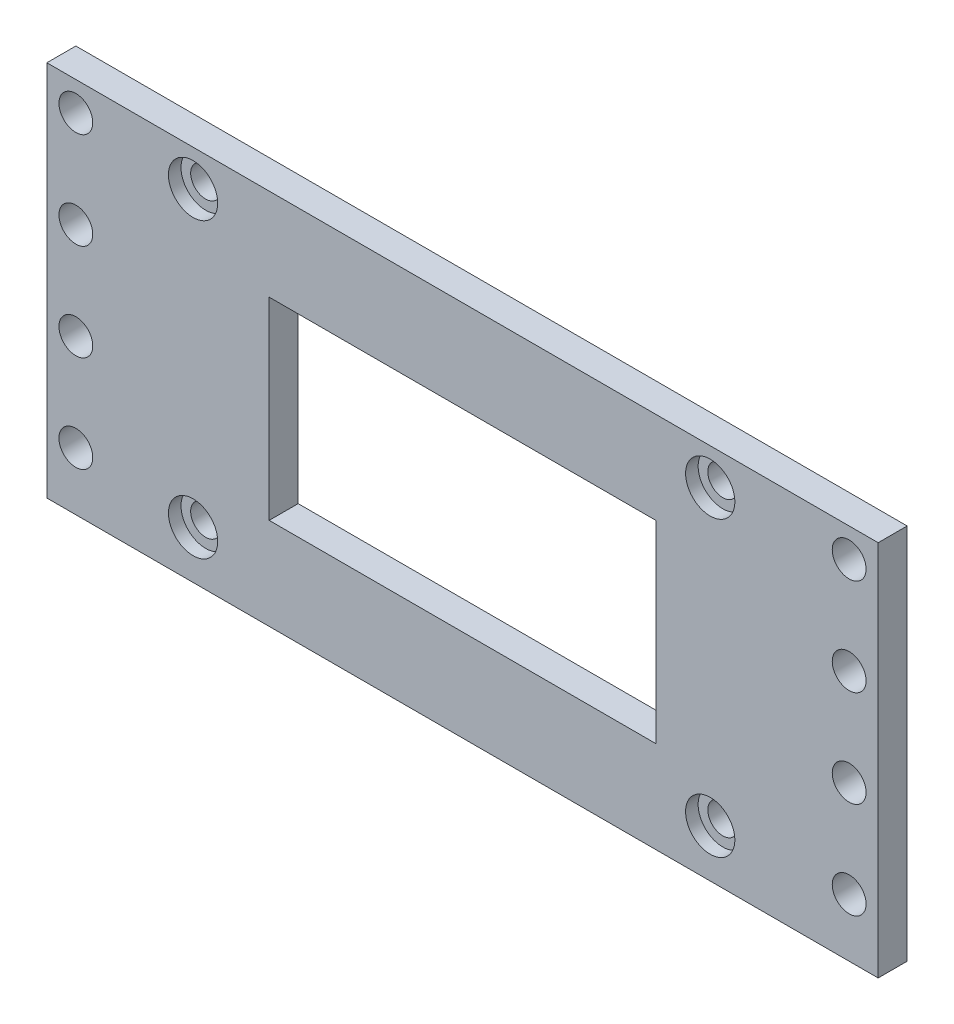
ISO-10303-21;
HEADER;
FILE_DESCRIPTION(('STEP AP214'),'2;1');
FILE_NAME('part.step','',(''),(''),'','','');
FILE_SCHEMA(('AUTOMOTIVE_DESIGN { 1 0 10303 214 1 1 1 1 }'));
ENDSEC;
DATA;
#1=APPLICATION_CONTEXT('core data for automotive mechanical design processes');
#2=APPLICATION_PROTOCOL_DEFINITION('international standard','automotive_design',2000,#1);
#3=PRODUCT_CONTEXT('',#1,'mechanical');
#4=PRODUCT('Part','Part','',(#3));
#5=PRODUCT_RELATED_PRODUCT_CATEGORY('part','',(#4));
#6=PRODUCT_DEFINITION_FORMATION('','',#4);
#7=PRODUCT_DEFINITION_CONTEXT('part definition',#1,'design');
#8=PRODUCT_DEFINITION('design','',#6,#7);
#9=PRODUCT_DEFINITION_SHAPE('','',#8);
#10=(LENGTH_UNIT() NAMED_UNIT(*) SI_UNIT(.MILLI.,.METRE.));
#11=(NAMED_UNIT(*) PLANE_ANGLE_UNIT() SI_UNIT($,.RADIAN.));
#12=(NAMED_UNIT(*) SI_UNIT($,.STERADIAN.) SOLID_ANGLE_UNIT());
#13=UNCERTAINTY_MEASURE_WITH_UNIT(LENGTH_MEASURE(1.E-05),#10,'distance_accuracy_value','');
#14=(GEOMETRIC_REPRESENTATION_CONTEXT(3) GLOBAL_UNCERTAINTY_ASSIGNED_CONTEXT((#13)) GLOBAL_UNIT_ASSIGNED_CONTEXT((#10,
#11,#12)) REPRESENTATION_CONTEXT('',''));
#15=CARTESIAN_POINT('',(0.,0.,0.));
#16=DIRECTION('',(0.,0.,1.));
#17=DIRECTION('',(1.,0.,0.));
#18=AXIS2_PLACEMENT_3D('',#15,#16,#17);
#19=CARTESIAN_POINT('',(-27.8730845870091,15.75,3.));
#20=DIRECTION('',(0.,0.,-1.));
#21=DIRECTION('',(-1.,0.,0.));
#22=AXIS2_PLACEMENT_3D('',#19,#20,#21);
#23=CYLINDRICAL_SURFACE('',#22,1.55);
#24=CARTESIAN_POINT('',(-27.8730845870091,15.75,0.));
#25=DIRECTION('',(0.,0.,1.));
#26=DIRECTION('',(1.,0.,0.));
#27=AXIS2_PLACEMENT_3D('',#24,#25,#26);
#28=CIRCLE('',#27,1.55);
#29=CARTESIAN_POINT('',(-26.3230845870091,15.75,0.));
#30=VERTEX_POINT('',#29);
#31=EDGE_CURVE('E11',#30,#30,#28,.T.);
#32=ORIENTED_EDGE('',*,*,#31,.F.);
#33=EDGE_LOOP('',(#32));
#34=FACE_BOUND('',#33,.T.);
#35=CARTESIAN_POINT('',(-27.8730845870091,15.75,1.7));
#36=DIRECTION('',(0.,0.,1.));
#37=DIRECTION('',(1.,0.,0.));
#38=AXIS2_PLACEMENT_3D('',#35,#36,#37);
#39=CIRCLE('',#38,1.55);
#40=CARTESIAN_POINT('',(-26.3230845870091,15.75,1.7));
#41=VERTEX_POINT('',#40);
#42=EDGE_CURVE('E47',#41,#41,#39,.T.);
#43=ORIENTED_EDGE('',*,*,#42,.T.);
#44=EDGE_LOOP('',(#43));
#45=FACE_BOUND('',#44,.T.);
#46=ADVANCED_FACE('F43',(#34,#45),#23,.F.);
#47=CARTESIAN_POINT('',(25.6269154129909,15.75,3.));
#48=DIRECTION('',(0.,0.,-1.));
#49=DIRECTION('',(-1.,0.,0.));
#50=AXIS2_PLACEMENT_3D('',#47,#48,#49);
#51=CYLINDRICAL_SURFACE('',#50,1.55);
#52=CARTESIAN_POINT('',(25.6269154129909,15.75,0.));
#53=DIRECTION('',(0.,0.,1.));
#54=DIRECTION('',(-1.,0.,0.));
#55=AXIS2_PLACEMENT_3D('',#52,#53,#54);
#56=CIRCLE('',#55,1.55);
#57=CARTESIAN_POINT('',(24.0769154129909,15.75,0.));
#58=VERTEX_POINT('',#57);
#59=EDGE_CURVE('E53',#58,#58,#56,.T.);
#60=ORIENTED_EDGE('',*,*,#59,.F.);
#61=EDGE_LOOP('',(#60));
#62=FACE_BOUND('',#61,.T.);
#63=CARTESIAN_POINT('',(25.6269154129909,15.75,1.7));
#64=DIRECTION('',(0.,0.,1.));
#65=DIRECTION('',(1.,0.,0.));
#66=AXIS2_PLACEMENT_3D('',#63,#64,#65);
#67=CIRCLE('',#66,1.55);
#68=CARTESIAN_POINT('',(27.1769154129909,15.75,1.7));
#69=VERTEX_POINT('',#68);
#70=EDGE_CURVE('E213',#69,#69,#67,.T.);
#71=ORIENTED_EDGE('',*,*,#70,.T.);
#72=EDGE_LOOP('',(#71));
#73=FACE_BOUND('',#72,.T.);
#74=ADVANCED_FACE('F260',(#62,#73),#51,.F.);
#75=CARTESIAN_POINT('',(-27.8730845870091,-14.55,3.));
#76=DIRECTION('',(0.,0.,-1.));
#77=DIRECTION('',(-1.,0.,0.));
#78=AXIS2_PLACEMENT_3D('',#75,#76,#77);
#79=CYLINDRICAL_SURFACE('',#78,1.55);
#80=CARTESIAN_POINT('',(-27.8730845870091,-14.55,0.));
#81=DIRECTION('',(0.,0.,1.));
#82=DIRECTION('',(-1.,0.,0.));
#83=AXIS2_PLACEMENT_3D('',#80,#81,#82);
#84=CIRCLE('',#83,1.55);
#85=CARTESIAN_POINT('',(-29.4230845870091,-14.55,0.));
#86=VERTEX_POINT('',#85);
#87=EDGE_CURVE('E198',#86,#86,#84,.T.);
#88=ORIENTED_EDGE('',*,*,#87,.F.);
#89=EDGE_LOOP('',(#88));
#90=FACE_BOUND('',#89,.T.);
#91=CARTESIAN_POINT('',(-27.8730845870091,-14.55,1.7));
#92=DIRECTION('',(0.,0.,1.));
#93=DIRECTION('',(1.,0.,0.));
#94=AXIS2_PLACEMENT_3D('',#91,#92,#93);
#95=CIRCLE('',#94,1.55);
#96=CARTESIAN_POINT('',(-26.3230845870091,-14.55,1.7));
#97=VERTEX_POINT('',#96);
#98=EDGE_CURVE('E209',#97,#97,#95,.T.);
#99=ORIENTED_EDGE('',*,*,#98,.T.);
#100=EDGE_LOOP('',(#99));
#101=FACE_BOUND('',#100,.T.);
#102=ADVANCED_FACE('F266',(#90,#101),#79,.F.);
#103=CARTESIAN_POINT('',(25.6269154129909,-14.55,3.));
#104=DIRECTION('',(0.,0.,-1.));
#105=DIRECTION('',(-1.,0.,0.));
#106=AXIS2_PLACEMENT_3D('',#103,#104,#105);
#107=CYLINDRICAL_SURFACE('',#106,1.55);
#108=CARTESIAN_POINT('',(25.6269154129909,-14.55,0.));
#109=DIRECTION('',(0.,0.,1.));
#110=DIRECTION('',(1.,0.,0.));
#111=AXIS2_PLACEMENT_3D('',#108,#109,#110);
#112=CIRCLE('',#111,1.55);
#113=CARTESIAN_POINT('',(27.1769154129909,-14.55,0.));
#114=VERTEX_POINT('',#113);
#115=EDGE_CURVE('E194',#114,#114,#112,.T.);
#116=ORIENTED_EDGE('',*,*,#115,.F.);
#117=EDGE_LOOP('',(#116));
#118=FACE_BOUND('',#117,.T.);
#119=CARTESIAN_POINT('',(25.6269154129909,-14.55,1.7));
#120=DIRECTION('',(0.,0.,1.));
#121=DIRECTION('',(1.,0.,0.));
#122=AXIS2_PLACEMENT_3D('',#119,#120,#121);
#123=CIRCLE('',#122,1.55);
#124=CARTESIAN_POINT('',(27.1769154129909,-14.55,1.7));
#125=VERTEX_POINT('',#124);
#126=EDGE_CURVE('E205',#125,#125,#123,.T.);
#127=ORIENTED_EDGE('',*,*,#126,.T.);
#128=EDGE_LOOP('',(#127));
#129=FACE_BOUND('',#128,.T.);
#130=ADVANCED_FACE('F272',(#118,#129),#107,.F.);
#131=CARTESIAN_POINT('',(0.,0.,3.));
#132=DIRECTION('',(0.,0.,-1.));
#133=DIRECTION('',(-1.,0.,0.));
#134=AXIS2_PLACEMENT_3D('',#131,#132,#133);
#135=PLANE('',#134);
#136=CARTESIAN_POINT('',(-40.,-13.5,3.));
#137=DIRECTION('',(0.,0.,-1.));
#138=DIRECTION('',(-1.,0.,0.));
#139=AXIS2_PLACEMENT_3D('',#136,#137,#138);
#140=CIRCLE('',#139,1.75);
#141=CARTESIAN_POINT('',(-41.75,-13.5,3.));
#142=VERTEX_POINT('',#141);
#143=EDGE_CURVE('E285',#142,#142,#140,.T.);
#144=ORIENTED_EDGE('',*,*,#143,.T.);
#145=EDGE_LOOP('',(#144));
#146=FACE_BOUND('',#145,.T.);
#147=CARTESIAN_POINT('',(-40.,-3.5,3.));
#148=DIRECTION('',(0.,0.,-1.));
#149=DIRECTION('',(-1.,0.,0.));
#150=AXIS2_PLACEMENT_3D('',#147,#148,#149);
#151=CIRCLE('',#150,1.75);
#152=CARTESIAN_POINT('',(-41.75,-3.5,3.));
#153=VERTEX_POINT('',#152);
#154=EDGE_CURVE('E289',#153,#153,#151,.T.);
#155=ORIENTED_EDGE('',*,*,#154,.T.);
#156=EDGE_LOOP('',(#155));
#157=FACE_BOUND('',#156,.T.);
#158=CARTESIAN_POINT('',(-40.,6.5,3.));
#159=DIRECTION('',(0.,0.,-1.));
#160=DIRECTION('',(-1.,0.,0.));
#161=AXIS2_PLACEMENT_3D('',#158,#159,#160);
#162=CIRCLE('',#161,1.75);
#163=CARTESIAN_POINT('',(-41.75,6.5,3.));
#164=VERTEX_POINT('',#163);
#165=EDGE_CURVE('E293',#164,#164,#162,.T.);
#166=ORIENTED_EDGE('',*,*,#165,.T.);
#167=EDGE_LOOP('',(#166));
#168=FACE_BOUND('',#167,.T.);
#169=CARTESIAN_POINT('',(-40.,16.5,3.));
#170=DIRECTION('',(0.,0.,-1.));
#171=DIRECTION('',(-1.,0.,0.));
#172=AXIS2_PLACEMENT_3D('',#169,#170,#171);
#173=CIRCLE('',#172,1.75);
#174=CARTESIAN_POINT('',(-41.75,16.5,3.));
#175=VERTEX_POINT('',#174);
#176=EDGE_CURVE('E297',#175,#175,#173,.T.);
#177=ORIENTED_EDGE('',*,*,#176,.T.);
#178=EDGE_LOOP('',(#177));
#179=FACE_BOUND('',#178,.T.);
#180=CARTESIAN_POINT('',(40.,-13.5,3.));
#181=DIRECTION('',(0.,0.,-1.));
#182=DIRECTION('',(-1.,0.,0.));
#183=AXIS2_PLACEMENT_3D('',#180,#181,#182);
#184=CIRCLE('',#183,1.75);
#185=CARTESIAN_POINT('',(38.25,-13.5,3.));
#186=VERTEX_POINT('',#185);
#187=EDGE_CURVE('E301',#186,#186,#184,.T.);
#188=ORIENTED_EDGE('',*,*,#187,.T.);
#189=EDGE_LOOP('',(#188));
#190=FACE_BOUND('',#189,.T.);
#191=CARTESIAN_POINT('',(40.,-3.5,3.));
#192=DIRECTION('',(0.,0.,-1.));
#193=DIRECTION('',(-1.,0.,0.));
#194=AXIS2_PLACEMENT_3D('',#191,#192,#193);
#195=CIRCLE('',#194,1.75);
#196=CARTESIAN_POINT('',(38.25,-3.5,3.));
#197=VERTEX_POINT('',#196);
#198=EDGE_CURVE('E305',#197,#197,#195,.T.);
#199=ORIENTED_EDGE('',*,*,#198,.T.);
#200=EDGE_LOOP('',(#199));
#201=FACE_BOUND('',#200,.T.);
#202=CARTESIAN_POINT('',(40.,6.5,3.));
#203=DIRECTION('',(0.,0.,-1.));
#204=DIRECTION('',(-1.,0.,0.));
#205=AXIS2_PLACEMENT_3D('',#202,#203,#204);
#206=CIRCLE('',#205,1.75);
#207=CARTESIAN_POINT('',(38.25,6.5,3.));
#208=VERTEX_POINT('',#207);
#209=EDGE_CURVE('E309',#208,#208,#206,.T.);
#210=ORIENTED_EDGE('',*,*,#209,.T.);
#211=EDGE_LOOP('',(#210));
#212=FACE_BOUND('',#211,.T.);
#213=CARTESIAN_POINT('',(25.6269154129909,15.75,3.));
#214=DIRECTION('',(0.,0.,1.));
#215=DIRECTION('',(1.,0.,0.));
#216=AXIS2_PLACEMENT_3D('',#213,#214,#215);
#217=CIRCLE('',#216,2.55);
#218=CARTESIAN_POINT('',(28.1769154129909,15.75,3.));
#219=VERTEX_POINT('',#218);
#220=EDGE_CURVE('E313',#219,#219,#217,.T.);
#221=ORIENTED_EDGE('',*,*,#220,.F.);
#222=EDGE_LOOP('',(#221));
#223=FACE_BOUND('',#222,.T.);
#224=CARTESIAN_POINT('',(25.6269154129909,-14.55,3.));
#225=DIRECTION('',(0.,0.,1.));
#226=DIRECTION('',(1.,0.,0.));
#227=AXIS2_PLACEMENT_3D('',#224,#225,#226);
#228=CIRCLE('',#227,2.55);
#229=CARTESIAN_POINT('',(28.1769154129909,-14.55,3.));
#230=VERTEX_POINT('',#229);
#231=EDGE_CURVE('E317',#230,#230,#228,.T.);
#232=ORIENTED_EDGE('',*,*,#231,.F.);
#233=EDGE_LOOP('',(#232));
#234=FACE_BOUND('',#233,.T.);
#235=CARTESIAN_POINT('',(-27.8730845870091,-14.55,3.));
#236=DIRECTION('',(0.,0.,1.));
#237=DIRECTION('',(1.,0.,0.));
#238=AXIS2_PLACEMENT_3D('',#235,#236,#237);
#239=CIRCLE('',#238,2.55);
#240=CARTESIAN_POINT('',(-25.3230845870091,-14.55,3.));
#241=VERTEX_POINT('',#240);
#242=EDGE_CURVE('E321',#241,#241,#239,.T.);
#243=ORIENTED_EDGE('',*,*,#242,.F.);
#244=EDGE_LOOP('',(#243));
#245=FACE_BOUND('',#244,.T.);
#246=CARTESIAN_POINT('',(-27.8730845870091,15.75,3.));
#247=DIRECTION('',(0.,0.,1.));
#248=DIRECTION('',(1.,0.,0.));
#249=AXIS2_PLACEMENT_3D('',#246,#247,#248);
#250=CIRCLE('',#249,2.55);
#251=CARTESIAN_POINT('',(-25.3230845870091,15.75,3.));
#252=VERTEX_POINT('',#251);
#253=EDGE_CURVE('E325',#252,#252,#250,.T.);
#254=ORIENTED_EDGE('',*,*,#253,.F.);
#255=EDGE_LOOP('',(#254));
#256=FACE_BOUND('',#255,.T.);
#257=CARTESIAN_POINT('',(40.,16.5,3.));
#258=DIRECTION('',(0.,0.,-1.));
#259=DIRECTION('',(-1.,0.,0.));
#260=AXIS2_PLACEMENT_3D('',#257,#258,#259);
#261=CIRCLE('',#260,1.75);
#262=CARTESIAN_POINT('',(38.25,16.5,3.));
#263=VERTEX_POINT('',#262);
#264=EDGE_CURVE('E149',#263,#263,#261,.T.);
#265=ORIENTED_EDGE('',*,*,#264,.T.);
#266=EDGE_LOOP('',(#265));
#267=FACE_BOUND('',#266,.T.);
#268=DIRECTION('',(0.,1.,0.));
#269=VECTOR('',#268,1.);
#270=CARTESIAN_POINT('',(20.,-10.,3.));
#271=LINE('',#270,#269);
#272=CARTESIAN_POINT('',(20.,-10.,3.));
#273=VERTEX_POINT('',#272);
#274=CARTESIAN_POINT('',(20.,10.,3.));
#275=VERTEX_POINT('',#274);
#276=EDGE_CURVE('E156',#273,#275,#271,.T.);
#277=ORIENTED_EDGE('',*,*,#276,.F.);
#278=DIRECTION('',(1.,0.,0.));
#279=VECTOR('',#278,1.);
#280=CARTESIAN_POINT('',(-20.,-10.,3.));
#281=LINE('',#280,#279);
#282=CARTESIAN_POINT('',(-20.,-10.,3.));
#283=VERTEX_POINT('',#282);
#284=EDGE_CURVE('E166',#283,#273,#281,.T.);
#285=ORIENTED_EDGE('',*,*,#284,.F.);
#286=DIRECTION('',(0.,-1.,0.));
#287=VECTOR('',#286,1.);
#288=CARTESIAN_POINT('',(-20.,-10.,3.));
#289=LINE('',#288,#287);
#290=CARTESIAN_POINT('',(-20.,10.,3.));
#291=VERTEX_POINT('',#290);
#292=EDGE_CURVE('E163',#291,#283,#289,.T.);
#293=ORIENTED_EDGE('',*,*,#292,.F.);
#294=DIRECTION('',(-1.,0.,0.));
#295=VECTOR('',#294,1.);
#296=CARTESIAN_POINT('',(-20.,10.,3.));
#297=LINE('',#296,#295);
#298=EDGE_CURVE('E159',#275,#291,#297,.T.);
#299=ORIENTED_EDGE('',*,*,#298,.F.);
#300=EDGE_LOOP('',(#277,#285,#293,#299));
#301=FACE_BOUND('',#300,.T.);
#302=DIRECTION('',(1.,0.,0.));
#303=VECTOR('',#302,1.);
#304=CARTESIAN_POINT('',(-43.,-19.5,3.));
#305=LINE('',#304,#303);
#306=CARTESIAN_POINT('',(-43.,-19.5,3.));
#307=VERTEX_POINT('',#306);
#308=CARTESIAN_POINT('',(43.,-19.5,3.));
#309=VERTEX_POINT('',#308);
#310=EDGE_CURVE('E134',#307,#309,#305,.T.);
#311=ORIENTED_EDGE('',*,*,#310,.T.);
#312=DIRECTION('',(0.,1.,0.));
#313=VECTOR('',#312,1.);
#314=CARTESIAN_POINT('',(43.,-19.5,3.));
#315=LINE('',#314,#313);
#316=CARTESIAN_POINT('',(43.,19.5,3.));
#317=VERTEX_POINT('',#316);
#318=EDGE_CURVE('E237',#309,#317,#315,.T.);
#319=ORIENTED_EDGE('',*,*,#318,.T.);
#320=DIRECTION('',(-1.,0.,0.));
#321=VECTOR('',#320,1.);
#322=CARTESIAN_POINT('',(43.,19.5,3.));
#323=LINE('',#322,#321);
#324=CARTESIAN_POINT('',(-43.,19.5,3.));
#325=VERTEX_POINT('',#324);
#326=EDGE_CURVE('E129',#317,#325,#323,.T.);
#327=ORIENTED_EDGE('',*,*,#326,.T.);
#328=DIRECTION('',(0.,-1.,0.));
#329=VECTOR('',#328,1.);
#330=CARTESIAN_POINT('',(-43.,19.5,3.));
#331=LINE('',#330,#329);
#332=EDGE_CURVE('E173',#325,#307,#331,.T.);
#333=ORIENTED_EDGE('',*,*,#332,.T.);
#334=EDGE_LOOP('',(#311,#319,#327,#333));
#335=FACE_BOUND('',#334,.T.);
#336=ADVANCED_FACE('F243',(#146,#157,#168,#179,#190,#201,#212,#223,#234,#245,#256,#267,#301,
#335),#135,.F.);
#337=CARTESIAN_POINT('',(0.,0.,0.));
#338=DIRECTION('',(0.,0.,-1.));
#339=DIRECTION('',(-1.,0.,0.));
#340=AXIS2_PLACEMENT_3D('',#337,#338,#339);
#341=PLANE('',#340);
#342=CARTESIAN_POINT('',(-40.,-13.5,0.));
#343=DIRECTION('',(0.,0.,-1.));
#344=DIRECTION('',(-1.,0.,0.));
#345=AXIS2_PLACEMENT_3D('',#342,#343,#344);
#346=CIRCLE('',#345,1.75);
#347=CARTESIAN_POINT('',(-41.75,-13.5,0.));
#348=VERTEX_POINT('',#347);
#349=EDGE_CURVE('E690',#348,#348,#346,.T.);
#350=ORIENTED_EDGE('',*,*,#349,.F.);
#351=EDGE_LOOP('',(#350));
#352=FACE_BOUND('',#351,.T.);
#353=CARTESIAN_POINT('',(-40.,-3.5,0.));
#354=DIRECTION('',(0.,0.,-1.));
#355=DIRECTION('',(-1.,0.,0.));
#356=AXIS2_PLACEMENT_3D('',#353,#354,#355);
#357=CIRCLE('',#356,1.75);
#358=CARTESIAN_POINT('',(-41.75,-3.5,0.));
#359=VERTEX_POINT('',#358);
#360=EDGE_CURVE('E695',#359,#359,#357,.T.);
#361=ORIENTED_EDGE('',*,*,#360,.F.);
#362=EDGE_LOOP('',(#361));
#363=FACE_BOUND('',#362,.T.);
#364=CARTESIAN_POINT('',(-40.,6.5,0.));
#365=DIRECTION('',(0.,0.,-1.));
#366=DIRECTION('',(-1.,0.,0.));
#367=AXIS2_PLACEMENT_3D('',#364,#365,#366);
#368=CIRCLE('',#367,1.75);
#369=CARTESIAN_POINT('',(-41.75,6.5,0.));
#370=VERTEX_POINT('',#369);
#371=EDGE_CURVE('E704',#370,#370,#368,.T.);
#372=ORIENTED_EDGE('',*,*,#371,.F.);
#373=EDGE_LOOP('',(#372));
#374=FACE_BOUND('',#373,.T.);
#375=CARTESIAN_POINT('',(-40.,16.5,0.));
#376=DIRECTION('',(0.,0.,-1.));
#377=DIRECTION('',(-1.,0.,0.));
#378=AXIS2_PLACEMENT_3D('',#375,#376,#377);
#379=CIRCLE('',#378,1.75);
#380=CARTESIAN_POINT('',(-41.75,16.5,0.));
#381=VERTEX_POINT('',#380);
#382=EDGE_CURVE('E710',#381,#381,#379,.T.);
#383=ORIENTED_EDGE('',*,*,#382,.F.);
#384=EDGE_LOOP('',(#383));
#385=FACE_BOUND('',#384,.T.);
#386=CARTESIAN_POINT('',(40.,-13.5,0.));
#387=DIRECTION('',(0.,0.,-1.));
#388=DIRECTION('',(-1.,0.,0.));
#389=AXIS2_PLACEMENT_3D('',#386,#387,#388);
#390=CIRCLE('',#389,1.75);
#391=CARTESIAN_POINT('',(38.25,-13.5,0.));
#392=VERTEX_POINT('',#391);
#393=EDGE_CURVE('E716',#392,#392,#390,.T.);
#394=ORIENTED_EDGE('',*,*,#393,.F.);
#395=EDGE_LOOP('',(#394));
#396=FACE_BOUND('',#395,.T.);
#397=CARTESIAN_POINT('',(40.,-3.5,0.));
#398=DIRECTION('',(0.,0.,-1.));
#399=DIRECTION('',(-1.,0.,0.));
#400=AXIS2_PLACEMENT_3D('',#397,#398,#399);
#401=CIRCLE('',#400,1.75);
#402=CARTESIAN_POINT('',(38.25,-3.5,0.));
#403=VERTEX_POINT('',#402);
#404=EDGE_CURVE('E722',#403,#403,#401,.T.);
#405=ORIENTED_EDGE('',*,*,#404,.F.);
#406=EDGE_LOOP('',(#405));
#407=FACE_BOUND('',#406,.T.);
#408=CARTESIAN_POINT('',(40.,6.5,0.));
#409=DIRECTION('',(0.,0.,-1.));
#410=DIRECTION('',(-1.,0.,0.));
#411=AXIS2_PLACEMENT_3D('',#408,#409,#410);
#412=CIRCLE('',#411,1.75);
#413=CARTESIAN_POINT('',(38.25,6.5,0.));
#414=VERTEX_POINT('',#413);
#415=EDGE_CURVE('E386',#414,#414,#412,.T.);
#416=ORIENTED_EDGE('',*,*,#415,.F.);
#417=EDGE_LOOP('',(#416));
#418=FACE_BOUND('',#417,.T.);
#419=CARTESIAN_POINT('',(40.,16.5,0.));
#420=DIRECTION('',(0.,0.,-1.));
#421=DIRECTION('',(-1.,0.,0.));
#422=AXIS2_PLACEMENT_3D('',#419,#420,#421);
#423=CIRCLE('',#422,1.75);
#424=CARTESIAN_POINT('',(38.25,16.5,0.));
#425=VERTEX_POINT('',#424);
#426=EDGE_CURVE('E220',#425,#425,#423,.T.);
#427=ORIENTED_EDGE('',*,*,#426,.F.);
#428=EDGE_LOOP('',(#427));
#429=FACE_BOUND('',#428,.T.);
#430=ORIENTED_EDGE('',*,*,#87,.T.);
#431=EDGE_LOOP('',(#430));
#432=FACE_BOUND('',#431,.T.);
#433=ORIENTED_EDGE('',*,*,#31,.T.);
#434=EDGE_LOOP('',(#433));
#435=FACE_BOUND('',#434,.T.);
#436=ORIENTED_EDGE('',*,*,#59,.T.);
#437=EDGE_LOOP('',(#436));
#438=FACE_BOUND('',#437,.T.);
#439=ORIENTED_EDGE('',*,*,#115,.T.);
#440=EDGE_LOOP('',(#439));
#441=FACE_BOUND('',#440,.T.);
#442=DIRECTION('',(1.,0.,0.));
#443=VECTOR('',#442,1.);
#444=CARTESIAN_POINT('',(-20.,-10.,0.));
#445=LINE('',#444,#443);
#446=CARTESIAN_POINT('',(-20.,-10.,0.));
#447=VERTEX_POINT('',#446);
#448=CARTESIAN_POINT('',(20.,-10.,0.));
#449=VERTEX_POINT('',#448);
#450=EDGE_CURVE('E160',#447,#449,#445,.T.);
#451=ORIENTED_EDGE('',*,*,#450,.T.);
#452=DIRECTION('',(0.,1.,0.));
#453=VECTOR('',#452,1.);
#454=CARTESIAN_POINT('',(20.,-10.,0.));
#455=LINE('',#454,#453);
#456=CARTESIAN_POINT('',(20.,10.,0.));
#457=VERTEX_POINT('',#456);
#458=EDGE_CURVE('E69',#449,#457,#455,.T.);
#459=ORIENTED_EDGE('',*,*,#458,.T.);
#460=DIRECTION('',(-1.,0.,0.));
#461=VECTOR('',#460,1.);
#462=CARTESIAN_POINT('',(-20.,10.,0.));
#463=LINE('',#462,#461);
#464=CARTESIAN_POINT('',(-20.,10.,0.));
#465=VERTEX_POINT('',#464);
#466=EDGE_CURVE('E172',#457,#465,#463,.T.);
#467=ORIENTED_EDGE('',*,*,#466,.T.);
#468=DIRECTION('',(0.,-1.,0.));
#469=VECTOR('',#468,1.);
#470=CARTESIAN_POINT('',(-20.,-10.,0.));
#471=LINE('',#470,#469);
#472=EDGE_CURVE('E177',#465,#447,#471,.T.);
#473=ORIENTED_EDGE('',*,*,#472,.T.);
#474=EDGE_LOOP('',(#451,#459,#467,#473));
#475=FACE_BOUND('',#474,.T.);
#476=DIRECTION('',(1.,0.,0.));
#477=VECTOR('',#476,1.);
#478=CARTESIAN_POINT('',(-43.,-19.5,0.));
#479=LINE('',#478,#477);
#480=CARTESIAN_POINT('',(-43.,-19.5,0.));
#481=VERTEX_POINT('',#480);
#482=CARTESIAN_POINT('',(43.,-19.5,0.));
#483=VERTEX_POINT('',#482);
#484=EDGE_CURVE('E146',#481,#483,#479,.T.);
#485=ORIENTED_EDGE('',*,*,#484,.F.);
#486=DIRECTION('',(0.,-1.,0.));
#487=VECTOR('',#486,1.);
#488=CARTESIAN_POINT('',(-43.,19.5,0.));
#489=LINE('',#488,#487);
#490=CARTESIAN_POINT('',(-43.,19.5,0.));
#491=VERTEX_POINT('',#490);
#492=EDGE_CURVE('E118',#491,#481,#489,.T.);
#493=ORIENTED_EDGE('',*,*,#492,.F.);
#494=DIRECTION('',(-1.,0.,0.));
#495=VECTOR('',#494,1.);
#496=CARTESIAN_POINT('',(43.,19.5,0.));
#497=LINE('',#496,#495);
#498=CARTESIAN_POINT('',(43.,19.5,0.));
#499=VERTEX_POINT('',#498);
#500=EDGE_CURVE('E112',#499,#491,#497,.T.);
#501=ORIENTED_EDGE('',*,*,#500,.F.);
#502=DIRECTION('',(0.,1.,0.));
#503=VECTOR('',#502,1.);
#504=CARTESIAN_POINT('',(43.,-19.5,0.));
#505=LINE('',#504,#503);
#506=EDGE_CURVE('E115',#483,#499,#505,.T.);
#507=ORIENTED_EDGE('',*,*,#506,.F.);
#508=EDGE_LOOP('',(#485,#493,#501,#507));
#509=FACE_BOUND('',#508,.T.);
#510=ADVANCED_FACE('F45',(#352,#363,#374,#385,#396,#407,#418,#429,#432,#435,#438,#441,#475,
#509),#341,.T.);
#511=CARTESIAN_POINT('',(20.,-10.,3.));
#512=DIRECTION('',(-1.,0.,0.));
#513=DIRECTION('',(0.,0.,1.));
#514=AXIS2_PLACEMENT_3D('',#511,#512,#513);
#515=PLANE('',#514);
#516=ORIENTED_EDGE('',*,*,#458,.F.);
#517=DIRECTION('',(0.,0.,-1.));
#518=VECTOR('',#517,1.);
#519=CARTESIAN_POINT('',(20.,-10.,3.));
#520=LINE('',#519,#518);
#521=EDGE_CURVE('E169',#273,#449,#520,.T.);
#522=ORIENTED_EDGE('',*,*,#521,.F.);
#523=ORIENTED_EDGE('',*,*,#276,.T.);
#524=DIRECTION('',(0.,0.,-1.));
#525=VECTOR('',#524,1.);
#526=CARTESIAN_POINT('',(20.,10.,3.));
#527=LINE('',#526,#525);
#528=EDGE_CURVE('E191',#275,#457,#527,.T.);
#529=ORIENTED_EDGE('',*,*,#528,.T.);
#530=EDGE_LOOP('',(#516,#522,#523,#529));
#531=FACE_BOUND('',#530,.T.);
#532=ADVANCED_FACE('F278',(#531),#515,.T.);
#533=CARTESIAN_POINT('',(-20.,10.,3.));
#534=DIRECTION('',(0.,-1.,0.));
#535=DIRECTION('',(0.,0.,-1.));
#536=AXIS2_PLACEMENT_3D('',#533,#534,#535);
#537=PLANE('',#536);
#538=ORIENTED_EDGE('',*,*,#466,.F.);
#539=ORIENTED_EDGE('',*,*,#528,.F.);
#540=ORIENTED_EDGE('',*,*,#298,.T.);
#541=DIRECTION('',(0.,0.,-1.));
#542=VECTOR('',#541,1.);
#543=CARTESIAN_POINT('',(-20.,10.,3.));
#544=LINE('',#543,#542);
#545=EDGE_CURVE('E188',#291,#465,#544,.T.);
#546=ORIENTED_EDGE('',*,*,#545,.T.);
#547=EDGE_LOOP('',(#538,#539,#540,#546));
#548=FACE_BOUND('',#547,.T.);
#549=ADVANCED_FACE('F334',(#548),#537,.T.);
#550=CARTESIAN_POINT('',(-20.,-10.,3.));
#551=DIRECTION('',(1.,0.,0.));
#552=DIRECTION('',(0.,0.,-1.));
#553=AXIS2_PLACEMENT_3D('',#550,#551,#552);
#554=PLANE('',#553);
#555=ORIENTED_EDGE('',*,*,#472,.F.);
#556=ORIENTED_EDGE('',*,*,#545,.F.);
#557=ORIENTED_EDGE('',*,*,#292,.T.);
#558=DIRECTION('',(0.,0.,-1.));
#559=VECTOR('',#558,1.);
#560=CARTESIAN_POINT('',(-20.,-10.,3.));
#561=LINE('',#560,#559);
#562=EDGE_CURVE('E61',#283,#447,#561,.T.);
#563=ORIENTED_EDGE('',*,*,#562,.T.);
#564=EDGE_LOOP('',(#555,#556,#557,#563));
#565=FACE_BOUND('',#564,.T.);
#566=ADVANCED_FACE('F339',(#565),#554,.T.);
#567=CARTESIAN_POINT('',(-20.,-10.,3.));
#568=DIRECTION('',(0.,1.,0.));
#569=DIRECTION('',(0.,0.,1.));
#570=AXIS2_PLACEMENT_3D('',#567,#568,#569);
#571=PLANE('',#570);
#572=ORIENTED_EDGE('',*,*,#450,.F.);
#573=ORIENTED_EDGE('',*,*,#562,.F.);
#574=ORIENTED_EDGE('',*,*,#284,.T.);
#575=ORIENTED_EDGE('',*,*,#521,.T.);
#576=EDGE_LOOP('',(#572,#573,#574,#575));
#577=FACE_BOUND('',#576,.T.);
#578=ADVANCED_FACE('F257',(#577),#571,.T.);
#579=CARTESIAN_POINT('',(-43.,-19.5,-94.4298681562142));
#580=DIRECTION('',(0.,-1.,0.));
#581=DIRECTION('',(0.,0.,-1.));
#582=AXIS2_PLACEMENT_3D('',#579,#580,#581);
#583=PLANE('',#582);
#584=DIRECTION('',(0.,0.,1.));
#585=VECTOR('',#584,1.);
#586=CARTESIAN_POINT('',(-43.,-19.5,-94.4298681562142));
#587=LINE('',#586,#585);
#588=EDGE_CURVE('E123',#481,#307,#587,.T.);
#589=ORIENTED_EDGE('',*,*,#588,.F.);
#590=ORIENTED_EDGE('',*,*,#484,.T.);
#591=DIRECTION('',(0.,0.,1.));
#592=VECTOR('',#591,1.);
#593=CARTESIAN_POINT('',(43.,-19.5,-94.4298681562142));
#594=LINE('',#593,#592);
#595=EDGE_CURVE('E138',#483,#309,#594,.T.);
#596=ORIENTED_EDGE('',*,*,#595,.T.);
#597=ORIENTED_EDGE('',*,*,#310,.F.);
#598=EDGE_LOOP('',(#589,#590,#596,#597));
#599=FACE_BOUND('',#598,.T.);
#600=ADVANCED_FACE('F247',(#599),#583,.T.);
#601=CARTESIAN_POINT('',(-43.,19.5,-94.4298681562142));
#602=DIRECTION('',(-1.,0.,0.));
#603=DIRECTION('',(0.,0.,1.));
#604=AXIS2_PLACEMENT_3D('',#601,#602,#603);
#605=PLANE('',#604);
#606=DIRECTION('',(0.,0.,1.));
#607=VECTOR('',#606,1.);
#608=CARTESIAN_POINT('',(-43.,19.5,-94.4298681562142));
#609=LINE('',#608,#607);
#610=EDGE_CURVE('E122',#491,#325,#609,.T.);
#611=ORIENTED_EDGE('',*,*,#610,.F.);
#612=ORIENTED_EDGE('',*,*,#492,.T.);
#613=ORIENTED_EDGE('',*,*,#588,.T.);
#614=ORIENTED_EDGE('',*,*,#332,.F.);
#615=EDGE_LOOP('',(#611,#612,#613,#614));
#616=FACE_BOUND('',#615,.T.);
#617=ADVANCED_FACE('F249',(#616),#605,.T.);
#618=CARTESIAN_POINT('',(43.,19.5,-94.4298681562142));
#619=DIRECTION('',(0.,1.,0.));
#620=DIRECTION('',(0.,0.,1.));
#621=AXIS2_PLACEMENT_3D('',#618,#619,#620);
#622=PLANE('',#621);
#623=DIRECTION('',(0.,0.,1.));
#624=VECTOR('',#623,1.);
#625=CARTESIAN_POINT('',(43.,19.5,-94.4298681562142));
#626=LINE('',#625,#624);
#627=EDGE_CURVE('E126',#499,#317,#626,.T.);
#628=ORIENTED_EDGE('',*,*,#627,.F.);
#629=ORIENTED_EDGE('',*,*,#500,.T.);
#630=ORIENTED_EDGE('',*,*,#610,.T.);
#631=ORIENTED_EDGE('',*,*,#326,.F.);
#632=EDGE_LOOP('',(#628,#629,#630,#631));
#633=FACE_BOUND('',#632,.T.);
#634=ADVANCED_FACE('F127',(#633),#622,.T.);
#635=CARTESIAN_POINT('',(43.,-19.5,-94.4298681562142));
#636=DIRECTION('',(1.,0.,0.));
#637=DIRECTION('',(0.,0.,-1.));
#638=AXIS2_PLACEMENT_3D('',#635,#636,#637);
#639=PLANE('',#638);
#640=ORIENTED_EDGE('',*,*,#595,.F.);
#641=ORIENTED_EDGE('',*,*,#506,.T.);
#642=ORIENTED_EDGE('',*,*,#627,.T.);
#643=ORIENTED_EDGE('',*,*,#318,.F.);
#644=EDGE_LOOP('',(#640,#641,#642,#643));
#645=FACE_BOUND('',#644,.T.);
#646=ADVANCED_FACE('F137',(#645),#639,.T.);
#647=CARTESIAN_POINT('',(40.,16.5,3.));
#648=DIRECTION('',(0.,0.,-1.));
#649=DIRECTION('',(-1.,0.,0.));
#650=AXIS2_PLACEMENT_3D('',#647,#648,#649);
#651=CYLINDRICAL_SURFACE('',#650,1.75);
#652=ORIENTED_EDGE('',*,*,#264,.F.);
#653=EDGE_LOOP('',(#652));
#654=FACE_BOUND('',#653,.T.);
#655=ORIENTED_EDGE('',*,*,#426,.T.);
#656=EDGE_LOOP('',(#655));
#657=FACE_BOUND('',#656,.T.);
#658=ADVANCED_FACE('F408',(#654,#657),#651,.F.);
#659=CARTESIAN_POINT('',(25.6269154129909,-14.55,1.7));
#660=DIRECTION('',(0.,0.,1.));
#661=DIRECTION('',(1.,0.,0.));
#662=AXIS2_PLACEMENT_3D('',#659,#660,#661);
#663=CYLINDRICAL_SURFACE('',#662,2.55);
#664=CARTESIAN_POINT('',(25.6269154129909,-14.55,1.7));
#665=DIRECTION('',(0.,0.,1.));
#666=DIRECTION('',(1.,0.,0.));
#667=AXIS2_PLACEMENT_3D('',#664,#665,#666);
#668=CIRCLE('',#667,2.55);
#669=CARTESIAN_POINT('',(28.1769154129909,-14.55,1.7));
#670=VERTEX_POINT('',#669);
#671=EDGE_CURVE('E373',#670,#670,#668,.T.);
#672=ORIENTED_EDGE('',*,*,#671,.F.);
#673=EDGE_LOOP('',(#672));
#674=FACE_BOUND('',#673,.T.);
#675=ORIENTED_EDGE('',*,*,#231,.T.);
#676=EDGE_LOOP('',(#675));
#677=FACE_BOUND('',#676,.T.);
#678=ADVANCED_FACE('F411',(#674,#677),#663,.F.);
#679=CARTESIAN_POINT('',(25.6269154129909,-14.55,1.7));
#680=DIRECTION('',(0.,0.,1.));
#681=DIRECTION('',(1.,0.,0.));
#682=AXIS2_PLACEMENT_3D('',#679,#680,#681);
#683=PLANE('',#682);
#684=ORIENTED_EDGE('',*,*,#126,.F.);
#685=EDGE_LOOP('',(#684));
#686=FACE_BOUND('',#685,.T.);
#687=ORIENTED_EDGE('',*,*,#671,.T.);
#688=EDGE_LOOP('',(#687));
#689=FACE_BOUND('',#688,.T.);
#690=ADVANCED_FACE('F428',(#686,#689),#683,.T.);
#691=CARTESIAN_POINT('',(-27.8730845870091,-14.55,1.7));
#692=DIRECTION('',(0.,0.,1.));
#693=DIRECTION('',(1.,0.,0.));
#694=AXIS2_PLACEMENT_3D('',#691,#692,#693);
#695=CYLINDRICAL_SURFACE('',#694,2.55);
#696=CARTESIAN_POINT('',(-27.8730845870091,-14.55,1.7));
#697=DIRECTION('',(0.,0.,1.));
#698=DIRECTION('',(1.,0.,0.));
#699=AXIS2_PLACEMENT_3D('',#696,#697,#698);
#700=CIRCLE('',#699,2.55);
#701=CARTESIAN_POINT('',(-25.3230845870091,-14.55,1.7));
#702=VERTEX_POINT('',#701);
#703=EDGE_CURVE('E366',#702,#702,#700,.T.);
#704=ORIENTED_EDGE('',*,*,#703,.F.);
#705=EDGE_LOOP('',(#704));
#706=FACE_BOUND('',#705,.T.);
#707=ORIENTED_EDGE('',*,*,#242,.T.);
#708=EDGE_LOOP('',(#707));
#709=FACE_BOUND('',#708,.T.);
#710=ADVANCED_FACE('F362',(#706,#709),#695,.F.);
#711=CARTESIAN_POINT('',(-27.8730845870091,-14.55,1.7));
#712=DIRECTION('',(0.,0.,1.));
#713=DIRECTION('',(1.,0.,0.));
#714=AXIS2_PLACEMENT_3D('',#711,#712,#713);
#715=PLANE('',#714);
#716=ORIENTED_EDGE('',*,*,#98,.F.);
#717=EDGE_LOOP('',(#716));
#718=FACE_BOUND('',#717,.T.);
#719=ORIENTED_EDGE('',*,*,#703,.T.);
#720=EDGE_LOOP('',(#719));
#721=FACE_BOUND('',#720,.T.);
#722=ADVANCED_FACE('F358',(#718,#721),#715,.T.);
#723=CARTESIAN_POINT('',(25.6269154129909,15.75,1.7));
#724=DIRECTION('',(0.,0.,1.));
#725=DIRECTION('',(1.,0.,0.));
#726=AXIS2_PLACEMENT_3D('',#723,#724,#725);
#727=CYLINDRICAL_SURFACE('',#726,2.55);
#728=CARTESIAN_POINT('',(25.6269154129909,15.75,1.7));
#729=DIRECTION('',(0.,0.,1.));
#730=DIRECTION('',(1.,0.,0.));
#731=AXIS2_PLACEMENT_3D('',#728,#729,#730);
#732=CIRCLE('',#731,2.55);
#733=CARTESIAN_POINT('',(28.1769154129909,15.75,1.7));
#734=VERTEX_POINT('',#733);
#735=EDGE_CURVE('E382',#734,#734,#732,.T.);
#736=ORIENTED_EDGE('',*,*,#735,.F.);
#737=EDGE_LOOP('',(#736));
#738=FACE_BOUND('',#737,.T.);
#739=ORIENTED_EDGE('',*,*,#220,.T.);
#740=EDGE_LOOP('',(#739));
#741=FACE_BOUND('',#740,.T.);
#742=ADVANCED_FACE('F361',(#738,#741),#727,.F.);
#743=CARTESIAN_POINT('',(25.6269154129909,15.75,1.7));
#744=DIRECTION('',(0.,0.,1.));
#745=DIRECTION('',(1.,0.,0.));
#746=AXIS2_PLACEMENT_3D('',#743,#744,#745);
#747=PLANE('',#746);
#748=ORIENTED_EDGE('',*,*,#70,.F.);
#749=EDGE_LOOP('',(#748));
#750=FACE_BOUND('',#749,.T.);
#751=ORIENTED_EDGE('',*,*,#735,.T.);
#752=EDGE_LOOP('',(#751));
#753=FACE_BOUND('',#752,.T.);
#754=ADVANCED_FACE('F394',(#750,#753),#747,.T.);
#755=CARTESIAN_POINT('',(-27.8730845870091,15.75,1.7));
#756=DIRECTION('',(0.,0.,1.));
#757=DIRECTION('',(1.,0.,0.));
#758=AXIS2_PLACEMENT_3D('',#755,#756,#757);
#759=CYLINDRICAL_SURFACE('',#758,2.55);
#760=CARTESIAN_POINT('',(-27.8730845870091,15.75,1.7));
#761=DIRECTION('',(0.,0.,1.));
#762=DIRECTION('',(1.,0.,0.));
#763=AXIS2_PLACEMENT_3D('',#760,#761,#762);
#764=CIRCLE('',#763,2.55);
#765=CARTESIAN_POINT('',(-25.3230845870091,15.75,1.7));
#766=VERTEX_POINT('',#765);
#767=EDGE_CURVE('E210',#766,#766,#764,.T.);
#768=ORIENTED_EDGE('',*,*,#767,.F.);
#769=EDGE_LOOP('',(#768));
#770=FACE_BOUND('',#769,.T.);
#771=ORIENTED_EDGE('',*,*,#253,.T.);
#772=EDGE_LOOP('',(#771));
#773=FACE_BOUND('',#772,.T.);
#774=ADVANCED_FACE('F391',(#770,#773),#759,.F.);
#775=CARTESIAN_POINT('',(-27.8730845870091,15.75,1.7));
#776=DIRECTION('',(0.,0.,1.));
#777=DIRECTION('',(1.,0.,0.));
#778=AXIS2_PLACEMENT_3D('',#775,#776,#777);
#779=PLANE('',#778);
#780=ORIENTED_EDGE('',*,*,#42,.F.);
#781=EDGE_LOOP('',(#780));
#782=FACE_BOUND('',#781,.T.);
#783=ORIENTED_EDGE('',*,*,#767,.T.);
#784=EDGE_LOOP('',(#783));
#785=FACE_BOUND('',#784,.T.);
#786=ADVANCED_FACE('F393',(#782,#785),#779,.T.);
#787=CARTESIAN_POINT('',(40.,6.5,3.));
#788=DIRECTION('',(0.,0.,-1.));
#789=DIRECTION('',(-1.,0.,0.));
#790=AXIS2_PLACEMENT_3D('',#787,#788,#789);
#791=CYLINDRICAL_SURFACE('',#790,1.75);
#792=ORIENTED_EDGE('',*,*,#209,.F.);
#793=EDGE_LOOP('',(#792));
#794=FACE_BOUND('',#793,.T.);
#795=ORIENTED_EDGE('',*,*,#415,.T.);
#796=EDGE_LOOP('',(#795));
#797=FACE_BOUND('',#796,.T.);
#798=ADVANCED_FACE('F401',(#794,#797),#791,.F.);
#799=CARTESIAN_POINT('',(40.,-3.5,3.));
#800=DIRECTION('',(0.,0.,-1.));
#801=DIRECTION('',(-1.,0.,0.));
#802=AXIS2_PLACEMENT_3D('',#799,#800,#801);
#803=CYLINDRICAL_SURFACE('',#802,1.75);
#804=ORIENTED_EDGE('',*,*,#198,.F.);
#805=EDGE_LOOP('',(#804));
#806=FACE_BOUND('',#805,.T.);
#807=ORIENTED_EDGE('',*,*,#404,.T.);
#808=EDGE_LOOP('',(#807));
#809=FACE_BOUND('',#808,.T.);
#810=ADVANCED_FACE('F495',(#806,#809),#803,.F.);
#811=CARTESIAN_POINT('',(40.,-13.5,3.));
#812=DIRECTION('',(0.,0.,-1.));
#813=DIRECTION('',(-1.,0.,0.));
#814=AXIS2_PLACEMENT_3D('',#811,#812,#813);
#815=CYLINDRICAL_SURFACE('',#814,1.75);
#816=ORIENTED_EDGE('',*,*,#187,.F.);
#817=EDGE_LOOP('',(#816));
#818=FACE_BOUND('',#817,.T.);
#819=ORIENTED_EDGE('',*,*,#393,.T.);
#820=EDGE_LOOP('',(#819));
#821=FACE_BOUND('',#820,.T.);
#822=ADVANCED_FACE('F506',(#818,#821),#815,.F.);
#823=CARTESIAN_POINT('',(-40.,16.5,3.));
#824=DIRECTION('',(0.,0.,-1.));
#825=DIRECTION('',(-1.,0.,0.));
#826=AXIS2_PLACEMENT_3D('',#823,#824,#825);
#827=CYLINDRICAL_SURFACE('',#826,1.75);
#828=ORIENTED_EDGE('',*,*,#176,.F.);
#829=EDGE_LOOP('',(#828));
#830=FACE_BOUND('',#829,.T.);
#831=ORIENTED_EDGE('',*,*,#382,.T.);
#832=EDGE_LOOP('',(#831));
#833=FACE_BOUND('',#832,.T.);
#834=ADVANCED_FACE('F517',(#830,#833),#827,.F.);
#835=CARTESIAN_POINT('',(-40.,6.5,3.));
#836=DIRECTION('',(0.,0.,-1.));
#837=DIRECTION('',(-1.,0.,0.));
#838=AXIS2_PLACEMENT_3D('',#835,#836,#837);
#839=CYLINDRICAL_SURFACE('',#838,1.75);
#840=ORIENTED_EDGE('',*,*,#165,.F.);
#841=EDGE_LOOP('',(#840));
#842=FACE_BOUND('',#841,.T.);
#843=ORIENTED_EDGE('',*,*,#371,.T.);
#844=EDGE_LOOP('',(#843));
#845=FACE_BOUND('',#844,.T.);
#846=ADVANCED_FACE('F528',(#842,#845),#839,.F.);
#847=CARTESIAN_POINT('',(-40.,-3.5,3.));
#848=DIRECTION('',(0.,0.,-1.));
#849=DIRECTION('',(-1.,0.,0.));
#850=AXIS2_PLACEMENT_3D('',#847,#848,#849);
#851=CYLINDRICAL_SURFACE('',#850,1.75);
#852=ORIENTED_EDGE('',*,*,#154,.F.);
#853=EDGE_LOOP('',(#852));
#854=FACE_BOUND('',#853,.T.);
#855=ORIENTED_EDGE('',*,*,#360,.T.);
#856=EDGE_LOOP('',(#855));
#857=FACE_BOUND('',#856,.T.);
#858=ADVANCED_FACE('F539',(#854,#857),#851,.F.);
#859=CARTESIAN_POINT('',(-40.,-13.5,3.));
#860=DIRECTION('',(0.,0.,-1.));
#861=DIRECTION('',(-1.,0.,0.));
#862=AXIS2_PLACEMENT_3D('',#859,#860,#861);
#863=CYLINDRICAL_SURFACE('',#862,1.75);
#864=ORIENTED_EDGE('',*,*,#143,.F.);
#865=EDGE_LOOP('',(#864));
#866=FACE_BOUND('',#865,.T.);
#867=ORIENTED_EDGE('',*,*,#349,.T.);
#868=EDGE_LOOP('',(#867));
#869=FACE_BOUND('',#868,.T.);
#870=ADVANCED_FACE('F550',(#866,#869),#863,.F.);
#871=CLOSED_SHELL('',(#46,#74,#102,#130,#336,#510,#532,#549,#566,#578,#600,#617,#634,#646,#658,
#678,#690,#710,#722,#742,#754,#774,#786,#798,#810,#822,#834,#846,#858,#870));
#872=MANIFOLD_SOLID_BREP('B2',#871);
#873=ADVANCED_BREP_SHAPE_REPRESENTATION('',(#18,#872),#14);
#874=SHAPE_DEFINITION_REPRESENTATION(#9,#873);
ENDSEC;
END-ISO-10303-21;
